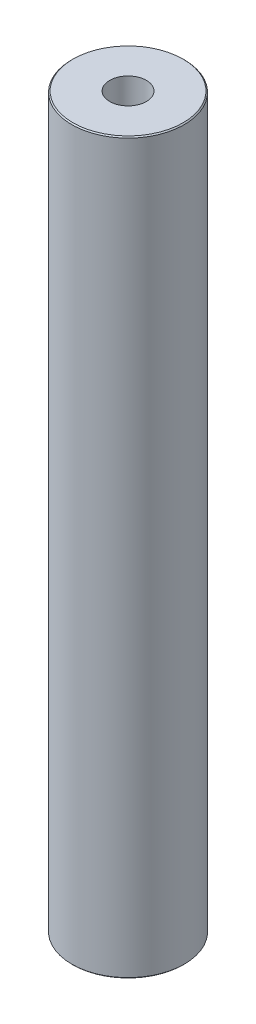
ISO-10303-21;
HEADER;
FILE_DESCRIPTION(('STEP AP214'),'2;1');
FILE_NAME('part.step','',(''),(''),'','','');
FILE_SCHEMA(('AUTOMOTIVE_DESIGN { 1 0 10303 214 1 1 1 1 }'));
ENDSEC;
DATA;
#1=APPLICATION_CONTEXT('core data for automotive mechanical design processes');
#2=APPLICATION_PROTOCOL_DEFINITION('international standard','automotive_design',2000,#1);
#3=PRODUCT_CONTEXT('',#1,'mechanical');
#4=PRODUCT('Part','Part','',(#3));
#5=PRODUCT_RELATED_PRODUCT_CATEGORY('part','',(#4));
#6=PRODUCT_DEFINITION_FORMATION('','',#4);
#7=PRODUCT_DEFINITION_CONTEXT('part definition',#1,'design');
#8=PRODUCT_DEFINITION('design','',#6,#7);
#9=PRODUCT_DEFINITION_SHAPE('','',#8);
#10=(LENGTH_UNIT() NAMED_UNIT(*) SI_UNIT(.MILLI.,.METRE.));
#11=(NAMED_UNIT(*) PLANE_ANGLE_UNIT() SI_UNIT($,.RADIAN.));
#12=(NAMED_UNIT(*) SI_UNIT($,.STERADIAN.) SOLID_ANGLE_UNIT());
#13=UNCERTAINTY_MEASURE_WITH_UNIT(LENGTH_MEASURE(1.E-05),#10,'distance_accuracy_value','');
#14=(GEOMETRIC_REPRESENTATION_CONTEXT(3) GLOBAL_UNCERTAINTY_ASSIGNED_CONTEXT((#13)) GLOBAL_UNIT_ASSIGNED_CONTEXT((#10,
#11,#12)) REPRESENTATION_CONTEXT('',''));
#15=CARTESIAN_POINT('',(0.,0.,0.));
#16=DIRECTION('',(0.,0.,1.));
#17=DIRECTION('',(1.,0.,0.));
#18=AXIS2_PLACEMENT_3D('',#15,#16,#17);
#19=CARTESIAN_POINT('',(0.,421.437707118203,0.));
#20=DIRECTION('',(0.,-1.,0.));
#21=DIRECTION('',(0.,0.,-1.));
#22=AXIS2_PLACEMENT_3D('',#19,#20,#21);
#23=CYLINDRICAL_SURFACE('',#22,32.5);
#24=CARTESIAN_POINT('',(0.,420.794333261473,0.));
#25=DIRECTION('',(0.,1.,0.));
#26=DIRECTION('',(0.,0.,1.));
#27=AXIS2_PLACEMENT_3D('',#24,#25,#26);
#28=CIRCLE('',#27,32.5);
#29=CARTESIAN_POINT('',(0.,420.794333261473,-32.5));
#30=VERTEX_POINT('',#29);
#31=EDGE_CURVE('E50',#30,#30,#28,.F.);
#32=CARTESIAN_POINT('',(0.,0.643373856730245,0.));
#33=DIRECTION('',(0.,1.,0.));
#34=DIRECTION('',(0.,0.,1.));
#35=AXIS2_PLACEMENT_3D('',#32,#33,#34);
#36=CIRCLE('',#35,32.5);
#37=CARTESIAN_POINT('',(0.,0.643373856730245,-32.5));
#38=VERTEX_POINT('',#37);
#39=EDGE_CURVE('E51',#38,#38,#36,.T.);
#40=CARTESIAN_POINT('',(0.,420.794333261473,-32.5));
#41=CARTESIAN_POINT('',(0.,416.417760767674,-32.5));
#42=CARTESIAN_POINT('',(0.,412.041188273874,-32.5));
#43=CARTESIAN_POINT('',(0.,403.288043286275,-32.5));
#44=CARTESIAN_POINT('',(0.,398.911470792476,-32.5));
#45=CARTESIAN_POINT('',(0.,390.158325804877,-32.5));
#46=CARTESIAN_POINT('',(0.,385.781753311078,-32.5));
#47=CARTESIAN_POINT('',(0.,377.028608323479,-32.5));
#48=CARTESIAN_POINT('',(0.,372.65203582968,-32.5));
#49=CARTESIAN_POINT('',(0.,363.898890842081,-32.5));
#50=CARTESIAN_POINT('',(0.,359.522318348281,-32.5));
#51=CARTESIAN_POINT('',(0.,350.769173360683,-32.5));
#52=CARTESIAN_POINT('',(0.,346.392600866883,-32.5));
#53=CARTESIAN_POINT('',(0.,337.639455879284,-32.5));
#54=CARTESIAN_POINT('',(0.,333.262883385485,-32.5));
#55=CARTESIAN_POINT('',(0.,324.509738397886,-32.5));
#56=CARTESIAN_POINT('',(0.,320.133165904087,-32.5));
#57=CARTESIAN_POINT('',(0.,311.380020916488,-32.5));
#58=CARTESIAN_POINT('',(0.,307.003448422689,-32.5));
#59=CARTESIAN_POINT('',(0.,298.25030343509,-32.5));
#60=CARTESIAN_POINT('',(0.,293.87373094129,-32.5));
#61=CARTESIAN_POINT('',(0.,285.120585953691,-32.5));
#62=CARTESIAN_POINT('',(0.,280.744013459892,-32.5));
#63=CARTESIAN_POINT('',(0.,271.990868472293,-32.5));
#64=CARTESIAN_POINT('',(0.,267.614295978494,-32.5));
#65=CARTESIAN_POINT('',(0.,258.861150990895,-32.5));
#66=CARTESIAN_POINT('',(0.,254.484578497096,-32.5));
#67=CARTESIAN_POINT('',(0.,245.731433509497,-32.5));
#68=CARTESIAN_POINT('',(0.,241.354861015697,-32.5));
#69=CARTESIAN_POINT('',(0.,232.601716028099,-32.5));
#70=CARTESIAN_POINT('',(0.,228.225143534299,-32.5));
#71=CARTESIAN_POINT('',(0.,219.4719985467,-32.5));
#72=CARTESIAN_POINT('',(0.,215.095426052901,-32.5));
#73=CARTESIAN_POINT('',(0.,206.342281065302,-32.5));
#74=CARTESIAN_POINT('',(0.,201.965708571503,-32.5));
#75=CARTESIAN_POINT('',(0.,193.212563583904,-32.5));
#76=CARTESIAN_POINT('',(0.,188.835991090105,-32.5));
#77=CARTESIAN_POINT('',(0.,180.082846102506,-32.5));
#78=CARTESIAN_POINT('',(0.,175.706273608706,-32.5));
#79=CARTESIAN_POINT('',(0.,166.953128621108,-32.5));
#80=CARTESIAN_POINT('',(0.,162.576556127308,-32.5));
#81=CARTESIAN_POINT('',(0.,153.823411139709,-32.5));
#82=CARTESIAN_POINT('',(0.,149.44683864591,-32.5));
#83=CARTESIAN_POINT('',(0.,140.693693658311,-32.5));
#84=CARTESIAN_POINT('',(0.,136.317121164512,-32.5));
#85=CARTESIAN_POINT('',(0.,127.563976176913,-32.5));
#86=CARTESIAN_POINT('',(0.,123.187403683114,-32.5));
#87=CARTESIAN_POINT('',(0.,114.434258695515,-32.5));
#88=CARTESIAN_POINT('',(0.,110.057686201715,-32.5));
#89=CARTESIAN_POINT('',(0.,101.304541214117,-32.5));
#90=CARTESIAN_POINT('',(0.,96.9279687203171,-32.5));
#91=CARTESIAN_POINT('',(0.,88.1748237327183,-32.5));
#92=CARTESIAN_POINT('',(0.,83.798251238919,-32.5));
#93=CARTESIAN_POINT('',(0.,75.0451062513202,-32.5));
#94=CARTESIAN_POINT('',(0.,70.6685337575207,-32.5));
#95=CARTESIAN_POINT('',(0.,61.9153887699219,-32.5));
#96=CARTESIAN_POINT('',(0.,57.5388162761225,-32.5));
#97=CARTESIAN_POINT('',(0.,48.7856712885237,-32.5));
#98=CARTESIAN_POINT('',(0.,44.4090987947243,-32.5));
#99=CARTESIAN_POINT('',(0.,35.6559538071255,-32.5));
#100=CARTESIAN_POINT('',(0.,31.2793813133261,-32.5));
#101=CARTESIAN_POINT('',(0.,22.5262363257273,-32.5));
#102=CARTESIAN_POINT('',(0.,18.1496638319279,-32.5));
#103=CARTESIAN_POINT('',(0.,9.39651884432907,-32.5));
#104=CARTESIAN_POINT('',(0.,5.01994635052965,-32.5));
#105=CARTESIAN_POINT('',(0.,0.643373856730245,-32.5));
#106=B_SPLINE_CURVE_WITH_KNOTS('',3,(#40,#41,#42,#43,#44,#45,#46,#47,#48,#49,#50,#51,#52,#53,
#54,#55,#56,#57,#58,#59,#60,#61,#62,#63,#64,#65,#66,#67,#68,#69,#70,#71,#72,#73,#74,#75,#76,#77,
#78,#79,#80,#81,#82,#83,#84,#85,#86,#87,#88,#89,#90,#91,#92,#93,#94,#95,#96,#97,#98,#99,#100,
#101,#102,#103,#104,#105),.UNSPECIFIED.,.F.,.F.,(4,2,2,2,2,2,2,2,2,2,2,2,2,2,2,2,2,2,2,2,2,2,2,
2,2,2,2,2,2,2,2,2,4),(0.,13.1297174813982,26.2594349627964,39.3891524441947,52.5188699255928,
65.6485874069911,78.7783048883893,91.9080223697875,105.037739851186,118.167457332584,
131.297174813982,144.42689229538,157.556609776779,170.686327258177,183.816044739575,
196.945762220973,210.075479702371,223.20519718377,236.334914665168,249.464632146566,
262.594349627964,275.724067109362,288.853784590761,301.983502072159,315.113219553557,
328.242937034955,341.372654516353,354.502371997752,367.63208947915,380.761806960548,
393.891524441946,407.021241923345,420.150959404743),.UNSPECIFIED.);
#107=EDGE_CURVE('BSEAM39',#30,#38,#106,.T.);
#108=ORIENTED_EDGE('',*,*,#31,.T.);
#109=ORIENTED_EDGE('',*,*,#39,.T.);
#110=ORIENTED_EDGE('',*,*,#107,.T.);
#111=ORIENTED_EDGE('',*,*,#107,.F.);
#112=EDGE_LOOP('',(#108,#110,#109,#111));
#113=FACE_BOUND('',#112,.T.);
#114=ADVANCED_FACE('F39',(#113),#23,.T.);
#115=CARTESIAN_POINT('',(0.,421.437707118203,0.));
#116=DIRECTION('',(0.,1.,0.));
#117=DIRECTION('',(0.,0.,1.));
#118=AXIS2_PLACEMENT_3D('',#115,#116,#117);
#119=PLANE('',#118);
#120=CARTESIAN_POINT('',(0.,421.437707118203,0.));
#121=DIRECTION('',(0.,1.,0.));
#122=DIRECTION('',(0.,0.,1.));
#123=AXIS2_PLACEMENT_3D('',#120,#121,#122);
#124=CIRCLE('',#123,31.8566261432703);
#125=CARTESIAN_POINT('',(0.,421.437707118203,31.8566261432703));
#126=VERTEX_POINT('',#125);
#127=EDGE_CURVE('E54',#126,#126,#124,.T.);
#128=ORIENTED_EDGE('',*,*,#127,.T.);
#129=EDGE_LOOP('',(#128));
#130=FACE_BOUND('',#129,.T.);
#131=CARTESIAN_POINT('',(0.,421.437707118203,0.));
#132=DIRECTION('',(0.,1.,0.));
#133=DIRECTION('',(0.,0.,1.));
#134=AXIS2_PLACEMENT_3D('',#131,#132,#133);
#135=CIRCLE('',#134,10.608328309963);
#136=CARTESIAN_POINT('',(0.,421.437707118203,-10.608328309963));
#137=VERTEX_POINT('',#136);
#138=EDGE_CURVE('E58',#137,#137,#135,.T.);
#139=ORIENTED_EDGE('',*,*,#138,.F.);
#140=EDGE_LOOP('',(#139));
#141=FACE_BOUND('',#140,.T.);
#142=ADVANCED_FACE('F69',(#130,#141),#119,.T.);
#143=CARTESIAN_POINT('',(0.,0.,0.));
#144=DIRECTION('',(0.,1.,0.));
#145=DIRECTION('',(0.,0.,1.));
#146=AXIS2_PLACEMENT_3D('',#143,#144,#145);
#147=PLANE('',#146);
#148=CARTESIAN_POINT('',(0.,0.,0.));
#149=DIRECTION('',(0.,1.,0.));
#150=DIRECTION('',(0.,0.,1.));
#151=AXIS2_PLACEMENT_3D('',#148,#149,#150);
#152=CIRCLE('',#151,31.8566261432697);
#153=CARTESIAN_POINT('',(0.,0.,31.8566261432697));
#154=VERTEX_POINT('',#153);
#155=EDGE_CURVE('E10',#154,#154,#152,.F.);
#156=ORIENTED_EDGE('',*,*,#155,.T.);
#157=EDGE_LOOP('',(#156));
#158=FACE_BOUND('',#157,.T.);
#159=CARTESIAN_POINT('',(0.,0.,0.));
#160=DIRECTION('',(0.,1.,0.));
#161=DIRECTION('',(0.,0.,1.));
#162=AXIS2_PLACEMENT_3D('',#159,#160,#161);
#163=CIRCLE('',#162,10.608328309963);
#164=CARTESIAN_POINT('',(0.,0.,-10.608328309963));
#165=VERTEX_POINT('',#164);
#166=EDGE_CURVE('E63',#165,#165,#163,.T.);
#167=ORIENTED_EDGE('',*,*,#166,.T.);
#168=EDGE_LOOP('',(#167));
#169=FACE_BOUND('',#168,.T.);
#170=ADVANCED_FACE('F75',(#158,#169),#147,.F.);
#171=CARTESIAN_POINT('',(0.,421.437707118203,0.));
#172=DIRECTION('',(0.,-1.,0.));
#173=DIRECTION('',(0.,0.,-1.));
#174=AXIS2_PLACEMENT_3D('',#171,#172,#173);
#175=CYLINDRICAL_SURFACE('',#174,10.608328309963);
#176=CARTESIAN_POINT('',(0.,421.437707118203,-10.608328309963));
#177=CARTESIAN_POINT('',(0.,417.047731002388,-10.608328309963));
#178=CARTESIAN_POINT('',(0.,412.657754886573,-10.608328309963));
#179=CARTESIAN_POINT('',(0.,403.877802654944,-10.608328309963));
#180=CARTESIAN_POINT('',(0.,399.48782653913,-10.608328309963));
#181=CARTESIAN_POINT('',(0.,390.7078743075,-10.608328309963));
#182=CARTESIAN_POINT('',(0.,386.317898191686,-10.608328309963));
#183=CARTESIAN_POINT('',(0.,377.537945960057,-10.608328309963));
#184=CARTESIAN_POINT('',(0.,373.147969844242,-10.608328309963));
#185=CARTESIAN_POINT('',(0.,364.368017612613,-10.608328309963));
#186=CARTESIAN_POINT('',(0.,359.978041496798,-10.608328309963));
#187=CARTESIAN_POINT('',(0.,351.198089265169,-10.608328309963));
#188=CARTESIAN_POINT('',(0.,346.808113149354,-10.608328309963));
#189=CARTESIAN_POINT('',(0.,338.028160917725,-10.608328309963));
#190=CARTESIAN_POINT('',(0.,333.63818480191,-10.608328309963));
#191=CARTESIAN_POINT('',(0.,324.858232570281,-10.608328309963));
#192=CARTESIAN_POINT('',(0.,320.468256454467,-10.608328309963));
#193=CARTESIAN_POINT('',(0.,311.688304222837,-10.608328309963));
#194=CARTESIAN_POINT('',(0.,307.298328107023,-10.608328309963));
#195=CARTESIAN_POINT('',(0.,298.518375875394,-10.608328309963));
#196=CARTESIAN_POINT('',(0.,294.128399759579,-10.608328309963));
#197=CARTESIAN_POINT('',(0.,285.34844752795,-10.608328309963));
#198=CARTESIAN_POINT('',(0.,280.958471412135,-10.608328309963));
#199=CARTESIAN_POINT('',(0.,272.178519180506,-10.608328309963));
#200=CARTESIAN_POINT('',(0.,267.788543064691,-10.608328309963));
#201=CARTESIAN_POINT('',(0.,259.008590833062,-10.608328309963));
#202=CARTESIAN_POINT('',(0.,254.618614717247,-10.608328309963));
#203=CARTESIAN_POINT('',(0.,245.838662485618,-10.608328309963));
#204=CARTESIAN_POINT('',(0.,241.448686369804,-10.608328309963));
#205=CARTESIAN_POINT('',(0.,232.668734138174,-10.608328309963));
#206=CARTESIAN_POINT('',(0.,228.27875802236,-10.608328309963));
#207=CARTESIAN_POINT('',(0.,219.498805790731,-10.608328309963));
#208=CARTESIAN_POINT('',(0.,215.108829674916,-10.608328309963));
#209=CARTESIAN_POINT('',(0.,206.328877443287,-10.608328309963));
#210=CARTESIAN_POINT('',(0.,201.938901327472,-10.608328309963));
#211=CARTESIAN_POINT('',(0.,193.158949095843,-10.608328309963));
#212=CARTESIAN_POINT('',(0.,188.768972980028,-10.608328309963));
#213=CARTESIAN_POINT('',(0.,179.989020748399,-10.608328309963));
#214=CARTESIAN_POINT('',(0.,175.599044632584,-10.608328309963));
#215=CARTESIAN_POINT('',(0.,166.819092400955,-10.608328309963));
#216=CARTESIAN_POINT('',(0.,162.429116285141,-10.608328309963));
#217=CARTESIAN_POINT('',(0.,153.649164053511,-10.608328309963));
#218=CARTESIAN_POINT('',(0.,149.259187937697,-10.608328309963));
#219=CARTESIAN_POINT('',(0.,140.479235706068,-10.608328309963));
#220=CARTESIAN_POINT('',(0.,136.089259590253,-10.608328309963));
#221=CARTESIAN_POINT('',(0.,127.309307358624,-10.608328309963));
#222=CARTESIAN_POINT('',(0.,122.919331242809,-10.608328309963));
#223=CARTESIAN_POINT('',(0.,114.13937901118,-10.608328309963));
#224=CARTESIAN_POINT('',(0.,109.749402895365,-10.608328309963));
#225=CARTESIAN_POINT('',(0.,100.969450663736,-10.608328309963));
#226=CARTESIAN_POINT('',(0.,96.5794745479214,-10.608328309963));
#227=CARTESIAN_POINT('',(0.,87.7995223162922,-10.608328309963));
#228=CARTESIAN_POINT('',(0.,83.4095462004776,-10.608328309963));
#229=CARTESIAN_POINT('',(0.,74.6295939688484,-10.608328309963));
#230=CARTESIAN_POINT('',(0.,70.2396178530337,-10.608328309963));
#231=CARTESIAN_POINT('',(0.,61.4596656214045,-10.608328309963));
#232=CARTESIAN_POINT('',(0.,57.0696895055899,-10.608328309963));
#233=CARTESIAN_POINT('',(0.,48.2897372739607,-10.608328309963));
#234=CARTESIAN_POINT('',(0.,43.8997611581461,-10.608328309963));
#235=CARTESIAN_POINT('',(0.,35.1198089265168,-10.608328309963));
#236=CARTESIAN_POINT('',(0.,30.7298328107022,-10.608328309963));
#237=CARTESIAN_POINT('',(0.,21.949880579073,-10.608328309963));
#238=CARTESIAN_POINT('',(0.,17.5599044632584,-10.608328309963));
#239=CARTESIAN_POINT('',(0.,8.77995223162917,-10.608328309963));
#240=CARTESIAN_POINT('',(0.,4.38997611581456,-10.608328309963));
#241=CARTESIAN_POINT('',(0.,0.,-10.608328309963));
#242=B_SPLINE_CURVE_WITH_KNOTS('',3,(#176,#177,#178,#179,#180,#181,#182,#183,#184,#185,#186,
#187,#188,#189,#190,#191,#192,#193,#194,#195,#196,#197,#198,#199,#200,#201,#202,#203,#204,#205,
#206,#207,#208,#209,#210,#211,#212,#213,#214,#215,#216,#217,#218,#219,#220,#221,#222,#223,#224,
#225,#226,#227,#228,#229,#230,#231,#232,#233,#234,#235,#236,#237,#238,#239,#240,#241),
.UNSPECIFIED.,.F.,.F.,(4,2,2,2,2,2,2,2,2,2,2,2,2,2,2,2,2,2,2,2,2,2,2,2,2,2,2,2,2,2,2,2,4),(0.,
13.1699283474438,26.3398566948876,39.5097850423315,52.6797133897753,65.8496417372191,
79.019570084663,92.1894984321068,105.359426779551,118.529355126994,131.699283474438,
144.869211821882,158.039140169326,171.20906851677,184.378996864214,197.548925211657,
210.718853559101,223.888781906545,237.058710253989,250.228638601433,263.398566948877,
276.568495296321,289.738423643764,302.908351991208,316.078280338652,329.248208686096,
342.41813703354,355.588065380984,368.757993728427,381.927922075871,395.097850423315,
408.267778770759,421.437707118203),.UNSPECIFIED.);
#243=EDGE_CURVE('BSEAM70',#137,#165,#242,.T.);
#244=ORIENTED_EDGE('',*,*,#138,.T.);
#245=ORIENTED_EDGE('',*,*,#166,.F.);
#246=ORIENTED_EDGE('',*,*,#243,.T.);
#247=ORIENTED_EDGE('',*,*,#243,.F.);
#248=EDGE_LOOP('',(#244,#246,#245,#247));
#249=FACE_BOUND('',#248,.T.);
#250=ADVANCED_FACE('F70',(#249),#175,.F.);
#251=CARTESIAN_POINT('',(0.,421.437707118203,0.));
#252=DIRECTION('',(0.,-1.,0.));
#253=DIRECTION('',(0.,0.,-1.));
#254=AXIS2_PLACEMENT_3D('',#251,#252,#253);
#255=CONICAL_SURFACE('',#254,31.8566261432703,0.785398163397432);
#256=ORIENTED_EDGE('',*,*,#31,.F.);
#257=EDGE_LOOP('',(#256));
#258=FACE_BOUND('',#257,.T.);
#259=ORIENTED_EDGE('',*,*,#127,.F.);
#260=EDGE_LOOP('',(#259));
#261=FACE_BOUND('',#260,.T.);
#262=ADVANCED_FACE('F81',(#258,#261),#255,.T.);
#263=CARTESIAN_POINT('',(0.,0.643373856730245,0.));
#264=DIRECTION('',(0.,1.,0.));
#265=DIRECTION('',(0.,0.,1.));
#266=AXIS2_PLACEMENT_3D('',#263,#264,#265);
#267=CONICAL_SURFACE('',#266,32.5,0.78539816339747);
#268=ORIENTED_EDGE('',*,*,#155,.F.);
#269=EDGE_LOOP('',(#268));
#270=FACE_BOUND('',#269,.T.);
#271=ORIENTED_EDGE('',*,*,#39,.F.);
#272=EDGE_LOOP('',(#271));
#273=FACE_BOUND('',#272,.T.);
#274=ADVANCED_FACE('F45',(#270,#273),#267,.T.);
#275=CLOSED_SHELL('',(#114,#142,#170,#250,#262,#274));
#276=MANIFOLD_SOLID_BREP('B2',#275);
#277=ADVANCED_BREP_SHAPE_REPRESENTATION('',(#18,#276),#14);
#278=SHAPE_DEFINITION_REPRESENTATION(#9,#277);
ENDSEC;
END-ISO-10303-21;
